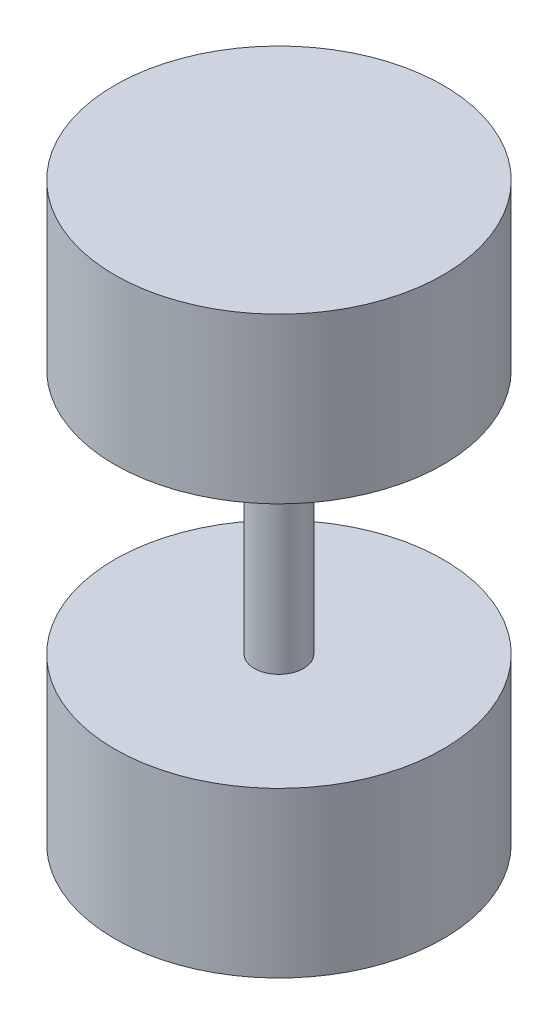
ISO-10303-21;
HEADER;
FILE_DESCRIPTION(('STEP AP214'),'2;1');
FILE_NAME('part.step','',(''),(''),'','','');
FILE_SCHEMA(('AUTOMOTIVE_DESIGN { 1 0 10303 214 1 1 1 1 }'));
ENDSEC;
DATA;
#1=APPLICATION_CONTEXT('core data for automotive mechanical design processes');
#2=APPLICATION_PROTOCOL_DEFINITION('international standard','automotive_design',2000,#1);
#3=PRODUCT_CONTEXT('',#1,'mechanical');
#4=PRODUCT('Part','Part','',(#3));
#5=PRODUCT_RELATED_PRODUCT_CATEGORY('part','',(#4));
#6=PRODUCT_DEFINITION_FORMATION('','',#4);
#7=PRODUCT_DEFINITION_CONTEXT('part definition',#1,'design');
#8=PRODUCT_DEFINITION('design','',#6,#7);
#9=PRODUCT_DEFINITION_SHAPE('','',#8);
#10=(LENGTH_UNIT() NAMED_UNIT(*) SI_UNIT(.MILLI.,.METRE.));
#11=(NAMED_UNIT(*) PLANE_ANGLE_UNIT() SI_UNIT($,.RADIAN.));
#12=(NAMED_UNIT(*) SI_UNIT($,.STERADIAN.) SOLID_ANGLE_UNIT());
#13=UNCERTAINTY_MEASURE_WITH_UNIT(LENGTH_MEASURE(1.E-05),#10,'distance_accuracy_value','');
#14=(GEOMETRIC_REPRESENTATION_CONTEXT(3) GLOBAL_UNCERTAINTY_ASSIGNED_CONTEXT((#13)) GLOBAL_UNIT_ASSIGNED_CONTEXT((#10,
#11,#12)) REPRESENTATION_CONTEXT('',''));
#15=CARTESIAN_POINT('',(0.,0.,0.));
#16=DIRECTION('',(0.,0.,1.));
#17=DIRECTION('',(1.,0.,0.));
#18=AXIS2_PLACEMENT_3D('',#15,#16,#17);
#19=CARTESIAN_POINT('',(0.,10.,0.));
#20=DIRECTION('',(0.,-1.,0.));
#21=DIRECTION('',(0.,0.,-1.));
#22=AXIS2_PLACEMENT_3D('',#19,#20,#21);
#23=CYLINDRICAL_SURFACE('',#22,10.);
#24=CARTESIAN_POINT('',(0.,10.,0.));
#25=DIRECTION('',(0.,1.,0.));
#26=DIRECTION('',(0.,0.,1.));
#27=AXIS2_PLACEMENT_3D('',#24,#25,#26);
#28=CIRCLE('',#27,10.);
#29=CARTESIAN_POINT('',(0.,10.,10.));
#30=VERTEX_POINT('',#29);
#31=EDGE_CURVE('E48',#30,#30,#28,.T.);
#32=ORIENTED_EDGE('',*,*,#31,.F.);
#33=EDGE_LOOP('',(#32));
#34=FACE_BOUND('',#33,.T.);
#35=CARTESIAN_POINT('',(0.,0.,0.));
#36=DIRECTION('',(0.,1.,0.));
#37=DIRECTION('',(0.,0.,1.));
#38=AXIS2_PLACEMENT_3D('',#35,#36,#37);
#39=CIRCLE('',#38,10.);
#40=CARTESIAN_POINT('',(0.,0.,10.));
#41=VERTEX_POINT('',#40);
#42=EDGE_CURVE('E42',#41,#41,#39,.T.);
#43=ORIENTED_EDGE('',*,*,#42,.T.);
#44=EDGE_LOOP('',(#43));
#45=FACE_BOUND('',#44,.T.);
#46=ADVANCED_FACE('F39',(#34,#45),#23,.T.);
#47=CARTESIAN_POINT('',(0.,10.,0.));
#48=DIRECTION('',(0.,1.,0.));
#49=DIRECTION('',(0.,0.,1.));
#50=AXIS2_PLACEMENT_3D('',#47,#48,#49);
#51=PLANE('',#50);
#52=CARTESIAN_POINT('',(0.,10.,0.));
#53=DIRECTION('',(0.,1.,0.));
#54=DIRECTION('',(0.,0.,1.));
#55=AXIS2_PLACEMENT_3D('',#52,#53,#54);
#56=CIRCLE('',#55,1.5);
#57=CARTESIAN_POINT('',(0.,10.,1.5));
#58=VERTEX_POINT('',#57);
#59=EDGE_CURVE('E11',#58,#58,#56,.T.);
#60=ORIENTED_EDGE('',*,*,#59,.F.);
#61=EDGE_LOOP('',(#60));
#62=FACE_BOUND('',#61,.T.);
#63=ORIENTED_EDGE('',*,*,#31,.T.);
#64=EDGE_LOOP('',(#63));
#65=FACE_BOUND('',#64,.T.);
#66=ADVANCED_FACE('F180',(#62,#65),#51,.T.);
#67=CARTESIAN_POINT('',(0.,0.,0.));
#68=DIRECTION('',(0.,1.,0.));
#69=DIRECTION('',(0.,0.,1.));
#70=AXIS2_PLACEMENT_3D('',#67,#68,#69);
#71=PLANE('',#70);
#72=DIRECTION('',(-0.5,0.,0.866025403784439));
#73=VECTOR('',#72,1.);
#74=CARTESIAN_POINT('',(7.,0.,0.));
#75=LINE('',#74,#73);
#76=CARTESIAN_POINT('',(7.,0.,0.));
#77=VERTEX_POINT('',#76);
#78=CARTESIAN_POINT('',(3.5,0.,6.06217782649107));
#79=VERTEX_POINT('',#78);
#80=EDGE_CURVE('E136',#77,#79,#75,.T.);
#81=ORIENTED_EDGE('',*,*,#80,.F.);
#82=DIRECTION('',(0.5,0.,0.866025403784439));
#83=VECTOR('',#82,1.);
#84=CARTESIAN_POINT('',(3.5,0.,-6.06217782649107));
#85=LINE('',#84,#83);
#86=CARTESIAN_POINT('',(3.5,0.,-6.06217782649107));
#87=VERTEX_POINT('',#86);
#88=EDGE_CURVE('E56',#87,#77,#85,.T.);
#89=ORIENTED_EDGE('',*,*,#88,.F.);
#90=DIRECTION('',(1.,0.,0.));
#91=VECTOR('',#90,1.);
#92=CARTESIAN_POINT('',(-3.5,0.,-6.06217782649107));
#93=LINE('',#92,#91);
#94=CARTESIAN_POINT('',(-3.5,0.,-6.06217782649107));
#95=VERTEX_POINT('',#94);
#96=EDGE_CURVE('E150',#95,#87,#93,.T.);
#97=ORIENTED_EDGE('',*,*,#96,.F.);
#98=DIRECTION('',(0.5,0.,-0.866025403784439));
#99=VECTOR('',#98,1.);
#100=CARTESIAN_POINT('',(-7.,0.,0.));
#101=LINE('',#100,#99);
#102=CARTESIAN_POINT('',(-7.,0.,0.));
#103=VERTEX_POINT('',#102);
#104=EDGE_CURVE('E147',#103,#95,#101,.T.);
#105=ORIENTED_EDGE('',*,*,#104,.F.);
#106=DIRECTION('',(-0.5,0.,-0.866025403784439));
#107=VECTOR('',#106,1.);
#108=CARTESIAN_POINT('',(-3.5,0.,6.06217782649107));
#109=LINE('',#108,#107);
#110=CARTESIAN_POINT('',(-3.5,0.,6.06217782649107));
#111=VERTEX_POINT('',#110);
#112=EDGE_CURVE('E104',#111,#103,#109,.T.);
#113=ORIENTED_EDGE('',*,*,#112,.F.);
#114=DIRECTION('',(-1.,0.,0.));
#115=VECTOR('',#114,1.);
#116=CARTESIAN_POINT('',(3.5,0.,6.06217782649107));
#117=LINE('',#116,#115);
#118=EDGE_CURVE('E141',#79,#111,#117,.T.);
#119=ORIENTED_EDGE('',*,*,#118,.F.);
#120=EDGE_LOOP('',(#81,#89,#97,#105,#113,#119));
#121=FACE_BOUND('',#120,.T.);
#122=ORIENTED_EDGE('',*,*,#42,.F.);
#123=EDGE_LOOP('',(#122));
#124=FACE_BOUND('',#123,.T.);
#125=ADVANCED_FACE('F177',(#121,#124),#71,.F.);
#126=CARTESIAN_POINT('',(0.,25.,0.));
#127=DIRECTION('',(0.,-1.,0.));
#128=DIRECTION('',(0.,0.,-1.));
#129=AXIS2_PLACEMENT_3D('',#126,#127,#128);
#130=CYLINDRICAL_SURFACE('',#129,1.5);
#131=CARTESIAN_POINT('',(0.,25.,0.));
#132=DIRECTION('',(0.,1.,0.));
#133=DIRECTION('',(0.,0.,1.));
#134=AXIS2_PLACEMENT_3D('',#131,#132,#133);
#135=CIRCLE('',#134,1.5);
#136=CARTESIAN_POINT('',(0.,25.,1.5));
#137=VERTEX_POINT('',#136);
#138=EDGE_CURVE('E156',#137,#137,#135,.T.);
#139=ORIENTED_EDGE('',*,*,#138,.F.);
#140=EDGE_LOOP('',(#139));
#141=FACE_BOUND('',#140,.T.);
#142=ORIENTED_EDGE('',*,*,#59,.T.);
#143=EDGE_LOOP('',(#142));
#144=FACE_BOUND('',#143,.T.);
#145=ADVANCED_FACE('F179',(#141,#144),#130,.T.);
#146=CARTESIAN_POINT('',(3.5,8.,-6.06217782649107));
#147=DIRECTION('',(0.866025403784439,0.,-0.5));
#148=DIRECTION('',(-0.5,0.,-0.866025403784439));
#149=AXIS2_PLACEMENT_3D('',#146,#147,#148);
#150=PLANE('',#149);
#151=ORIENTED_EDGE('',*,*,#88,.T.);
#152=DIRECTION('',(0.,-1.,0.));
#153=VECTOR('',#152,1.);
#154=CARTESIAN_POINT('',(7.,8.,0.));
#155=LINE('',#154,#153);
#156=CARTESIAN_POINT('',(7.,8.,0.));
#157=VERTEX_POINT('',#156);
#158=EDGE_CURVE('E86',#157,#77,#155,.T.);
#159=ORIENTED_EDGE('',*,*,#158,.F.);
#160=DIRECTION('',(0.5,0.,0.866025403784439));
#161=VECTOR('',#160,1.);
#162=CARTESIAN_POINT('',(3.5,8.,-6.06217782649107));
#163=LINE('',#162,#161);
#164=CARTESIAN_POINT('',(3.5,8.,-6.06217782649107));
#165=VERTEX_POINT('',#164);
#166=EDGE_CURVE('E153',#165,#157,#163,.T.);
#167=ORIENTED_EDGE('',*,*,#166,.F.);
#168=DIRECTION('',(0.,-1.,0.));
#169=VECTOR('',#168,1.);
#170=CARTESIAN_POINT('',(3.5,8.,-6.06217782649107));
#171=LINE('',#170,#169);
#172=EDGE_CURVE('E64',#165,#87,#171,.T.);
#173=ORIENTED_EDGE('',*,*,#172,.T.);
#174=EDGE_LOOP('',(#151,#159,#167,#173));
#175=FACE_BOUND('',#174,.T.);
#176=ADVANCED_FACE('F186',(#175),#150,.F.);
#177=CARTESIAN_POINT('',(-3.5,8.,-6.06217782649107));
#178=DIRECTION('',(0.,0.,-1.));
#179=DIRECTION('',(-1.,0.,0.));
#180=AXIS2_PLACEMENT_3D('',#177,#178,#179);
#181=PLANE('',#180);
#182=ORIENTED_EDGE('',*,*,#96,.T.);
#183=ORIENTED_EDGE('',*,*,#172,.F.);
#184=DIRECTION('',(1.,0.,0.));
#185=VECTOR('',#184,1.);
#186=CARTESIAN_POINT('',(-3.5,8.,-6.06217782649107));
#187=LINE('',#186,#185);
#188=CARTESIAN_POINT('',(-3.5,8.,-6.06217782649107));
#189=VERTEX_POINT('',#188);
#190=EDGE_CURVE('E118',#189,#165,#187,.T.);
#191=ORIENTED_EDGE('',*,*,#190,.F.);
#192=DIRECTION('',(0.,-1.,0.));
#193=VECTOR('',#192,1.);
#194=CARTESIAN_POINT('',(-3.5,8.,-6.06217782649107));
#195=LINE('',#194,#193);
#196=EDGE_CURVE('E109',#189,#95,#195,.T.);
#197=ORIENTED_EDGE('',*,*,#196,.T.);
#198=EDGE_LOOP('',(#182,#183,#191,#197));
#199=FACE_BOUND('',#198,.T.);
#200=ADVANCED_FACE('F219',(#199),#181,.F.);
#201=CARTESIAN_POINT('',(-7.,8.,0.));
#202=DIRECTION('',(-0.866025403784439,0.,-0.5));
#203=DIRECTION('',(-0.5,0.,0.866025403784439));
#204=AXIS2_PLACEMENT_3D('',#201,#202,#203);
#205=PLANE('',#204);
#206=ORIENTED_EDGE('',*,*,#104,.T.);
#207=ORIENTED_EDGE('',*,*,#196,.F.);
#208=DIRECTION('',(0.5,0.,-0.866025403784439));
#209=VECTOR('',#208,1.);
#210=CARTESIAN_POINT('',(-7.,8.,0.));
#211=LINE('',#210,#209);
#212=CARTESIAN_POINT('',(-7.,8.,0.));
#213=VERTEX_POINT('',#212);
#214=EDGE_CURVE('E113',#213,#189,#211,.T.);
#215=ORIENTED_EDGE('',*,*,#214,.F.);
#216=DIRECTION('',(0.,-1.,0.));
#217=VECTOR('',#216,1.);
#218=CARTESIAN_POINT('',(-7.,8.,0.));
#219=LINE('',#218,#217);
#220=EDGE_CURVE('E97',#213,#103,#219,.T.);
#221=ORIENTED_EDGE('',*,*,#220,.T.);
#222=EDGE_LOOP('',(#206,#207,#215,#221));
#223=FACE_BOUND('',#222,.T.);
#224=ADVANCED_FACE('F114',(#223),#205,.F.);
#225=CARTESIAN_POINT('',(-3.5,8.,6.06217782649107));
#226=DIRECTION('',(-0.866025403784439,0.,0.5));
#227=DIRECTION('',(0.5,0.,0.866025403784439));
#228=AXIS2_PLACEMENT_3D('',#225,#226,#227);
#229=PLANE('',#228);
#230=ORIENTED_EDGE('',*,*,#112,.T.);
#231=ORIENTED_EDGE('',*,*,#220,.F.);
#232=DIRECTION('',(-0.5,0.,-0.866025403784439));
#233=VECTOR('',#232,1.);
#234=CARTESIAN_POINT('',(-3.5,8.,6.06217782649107));
#235=LINE('',#234,#233);
#236=CARTESIAN_POINT('',(-3.5,8.,6.06217782649107));
#237=VERTEX_POINT('',#236);
#238=EDGE_CURVE('E101',#237,#213,#235,.T.);
#239=ORIENTED_EDGE('',*,*,#238,.F.);
#240=DIRECTION('',(0.,-1.,0.));
#241=VECTOR('',#240,1.);
#242=CARTESIAN_POINT('',(-3.5,8.,6.06217782649107));
#243=LINE('',#242,#241);
#244=EDGE_CURVE('E110',#237,#111,#243,.T.);
#245=ORIENTED_EDGE('',*,*,#244,.T.);
#246=EDGE_LOOP('',(#230,#231,#239,#245));
#247=FACE_BOUND('',#246,.T.);
#248=ADVANCED_FACE('F99',(#247),#229,.F.);
#249=CARTESIAN_POINT('',(3.5,8.,6.06217782649107));
#250=DIRECTION('',(0.,0.,1.));
#251=DIRECTION('',(1.,0.,0.));
#252=AXIS2_PLACEMENT_3D('',#249,#250,#251);
#253=PLANE('',#252);
#254=ORIENTED_EDGE('',*,*,#118,.T.);
#255=ORIENTED_EDGE('',*,*,#244,.F.);
#256=DIRECTION('',(-1.,0.,0.));
#257=VECTOR('',#256,1.);
#258=CARTESIAN_POINT('',(3.5,8.,6.06217782649107));
#259=LINE('',#258,#257);
#260=CARTESIAN_POINT('',(3.5,8.,6.06217782649107));
#261=VERTEX_POINT('',#260);
#262=EDGE_CURVE('E124',#261,#237,#259,.T.);
#263=ORIENTED_EDGE('',*,*,#262,.F.);
#264=DIRECTION('',(0.,-1.,0.));
#265=VECTOR('',#264,1.);
#266=CARTESIAN_POINT('',(3.5,8.,6.06217782649107));
#267=LINE('',#266,#265);
#268=EDGE_CURVE('E161',#261,#79,#267,.T.);
#269=ORIENTED_EDGE('',*,*,#268,.T.);
#270=EDGE_LOOP('',(#254,#255,#263,#269));
#271=FACE_BOUND('',#270,.T.);
#272=ADVANCED_FACE('F244',(#271),#253,.F.);
#273=CARTESIAN_POINT('',(7.,8.,0.));
#274=DIRECTION('',(0.866025403784439,0.,0.5));
#275=DIRECTION('',(0.5,0.,-0.866025403784439));
#276=AXIS2_PLACEMENT_3D('',#273,#274,#275);
#277=PLANE('',#276);
#278=ORIENTED_EDGE('',*,*,#80,.T.);
#279=ORIENTED_EDGE('',*,*,#268,.F.);
#280=DIRECTION('',(-0.5,0.,0.866025403784439));
#281=VECTOR('',#280,1.);
#282=CARTESIAN_POINT('',(7.,8.,0.));
#283=LINE('',#282,#281);
#284=EDGE_CURVE('E128',#157,#261,#283,.T.);
#285=ORIENTED_EDGE('',*,*,#284,.F.);
#286=ORIENTED_EDGE('',*,*,#158,.T.);
#287=EDGE_LOOP('',(#278,#279,#285,#286));
#288=FACE_BOUND('',#287,.T.);
#289=ADVANCED_FACE('F253',(#288),#277,.F.);
#290=CARTESIAN_POINT('',(0.,8.,0.));
#291=DIRECTION('',(0.,-1.,0.));
#292=DIRECTION('',(0.,0.,-1.));
#293=AXIS2_PLACEMENT_3D('',#290,#291,#292);
#294=PLANE('',#293);
#295=ORIENTED_EDGE('',*,*,#166,.T.);
#296=ORIENTED_EDGE('',*,*,#284,.T.);
#297=ORIENTED_EDGE('',*,*,#262,.T.);
#298=ORIENTED_EDGE('',*,*,#238,.T.);
#299=ORIENTED_EDGE('',*,*,#214,.T.);
#300=ORIENTED_EDGE('',*,*,#190,.T.);
#301=EDGE_LOOP('',(#295,#296,#297,#298,#299,#300));
#302=FACE_BOUND('',#301,.T.);
#303=ADVANCED_FACE('F121',(#302),#294,.T.);
#304=CARTESIAN_POINT('',(0.,35.,0.));
#305=DIRECTION('',(0.,-1.,0.));
#306=DIRECTION('',(0.,0.,-1.));
#307=AXIS2_PLACEMENT_3D('',#304,#305,#306);
#308=CYLINDRICAL_SURFACE('',#307,10.);
#309=CARTESIAN_POINT('',(0.,35.,0.));
#310=DIRECTION('',(0.,1.,0.));
#311=DIRECTION('',(0.,0.,1.));
#312=AXIS2_PLACEMENT_3D('',#309,#310,#311);
#313=CIRCLE('',#312,10.);
#314=CARTESIAN_POINT('',(0.,35.,10.));
#315=VERTEX_POINT('',#314);
#316=EDGE_CURVE('E137',#315,#315,#313,.T.);
#317=ORIENTED_EDGE('',*,*,#316,.F.);
#318=EDGE_LOOP('',(#317));
#319=FACE_BOUND('',#318,.T.);
#320=CARTESIAN_POINT('',(0.,25.,0.));
#321=DIRECTION('',(0.,1.,0.));
#322=DIRECTION('',(0.,0.,1.));
#323=AXIS2_PLACEMENT_3D('',#320,#321,#322);
#324=CIRCLE('',#323,10.);
#325=CARTESIAN_POINT('',(0.,25.,10.));
#326=VERTEX_POINT('',#325);
#327=EDGE_CURVE('E309',#326,#326,#324,.T.);
#328=ORIENTED_EDGE('',*,*,#327,.T.);
#329=EDGE_LOOP('',(#328));
#330=FACE_BOUND('',#329,.T.);
#331=ADVANCED_FACE('F272',(#319,#330),#308,.T.);
#332=CARTESIAN_POINT('',(0.,35.,0.));
#333=DIRECTION('',(0.,1.,0.));
#334=DIRECTION('',(0.,0.,1.));
#335=AXIS2_PLACEMENT_3D('',#332,#333,#334);
#336=PLANE('',#335);
#337=ORIENTED_EDGE('',*,*,#316,.T.);
#338=EDGE_LOOP('',(#337));
#339=FACE_BOUND('',#338,.T.);
#340=ADVANCED_FACE('F281',(#339),#336,.T.);
#341=CARTESIAN_POINT('',(0.,25.,0.));
#342=DIRECTION('',(0.,1.,0.));
#343=DIRECTION('',(0.,0.,1.));
#344=AXIS2_PLACEMENT_3D('',#341,#342,#343);
#345=PLANE('',#344);
#346=ORIENTED_EDGE('',*,*,#138,.T.);
#347=EDGE_LOOP('',(#346));
#348=FACE_BOUND('',#347,.T.);
#349=ORIENTED_EDGE('',*,*,#327,.F.);
#350=EDGE_LOOP('',(#349));
#351=FACE_BOUND('',#350,.T.);
#352=ADVANCED_FACE('F291',(#348,#351),#345,.F.);
#353=CLOSED_SHELL('',(#46,#66,#125,#145,#176,#200,#224,#248,#272,#289,#303,#331,#340,#352));
#354=MANIFOLD_SOLID_BREP('B2',#353);
#355=ADVANCED_BREP_SHAPE_REPRESENTATION('',(#18,#354),#14);
#356=SHAPE_DEFINITION_REPRESENTATION(#9,#355);
ENDSEC;
END-ISO-10303-21;
